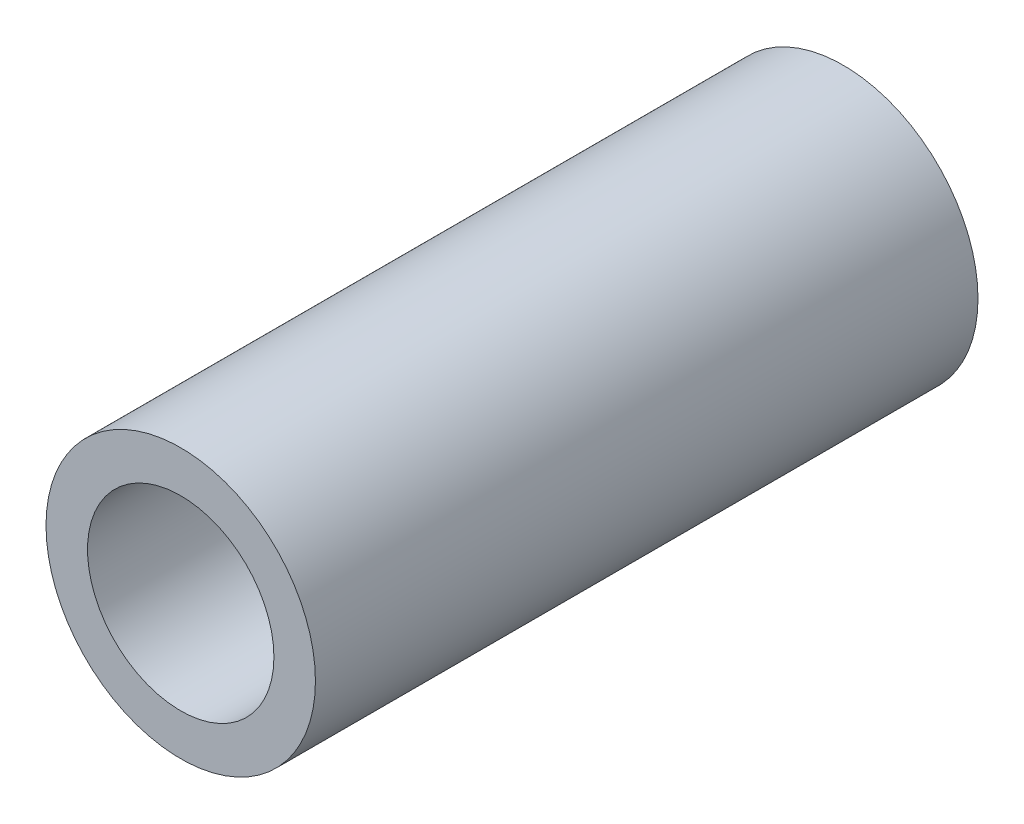
ISO-10303-21;
HEADER;
FILE_DESCRIPTION(('STEP AP214'),'2;1');
FILE_NAME('part.step','',(''),(''),'','','');
FILE_SCHEMA(('AUTOMOTIVE_DESIGN { 1 0 10303 214 1 1 1 1 }'));
ENDSEC;
DATA;
#1=APPLICATION_CONTEXT('core data for automotive mechanical design processes');
#2=APPLICATION_PROTOCOL_DEFINITION('international standard','automotive_design',2000,#1);
#3=PRODUCT_CONTEXT('',#1,'mechanical');
#4=PRODUCT('Part','Part','',(#3));
#5=PRODUCT_RELATED_PRODUCT_CATEGORY('part','',(#4));
#6=PRODUCT_DEFINITION_FORMATION('','',#4);
#7=PRODUCT_DEFINITION_CONTEXT('part definition',#1,'design');
#8=PRODUCT_DEFINITION('design','',#6,#7);
#9=PRODUCT_DEFINITION_SHAPE('','',#8);
#10=(LENGTH_UNIT() NAMED_UNIT(*) SI_UNIT(.MILLI.,.METRE.));
#11=(NAMED_UNIT(*) PLANE_ANGLE_UNIT() SI_UNIT($,.RADIAN.));
#12=(NAMED_UNIT(*) SI_UNIT($,.STERADIAN.) SOLID_ANGLE_UNIT());
#13=UNCERTAINTY_MEASURE_WITH_UNIT(LENGTH_MEASURE(1.E-05),#10,'distance_accuracy_value','');
#14=(GEOMETRIC_REPRESENTATION_CONTEXT(3) GLOBAL_UNCERTAINTY_ASSIGNED_CONTEXT((#13)) GLOBAL_UNIT_ASSIGNED_CONTEXT((#10,
#11,#12)) REPRESENTATION_CONTEXT('',''));
#15=CARTESIAN_POINT('',(0.,0.,0.));
#16=DIRECTION('',(0.,0.,1.));
#17=DIRECTION('',(1.,0.,0.));
#18=AXIS2_PLACEMENT_3D('',#15,#16,#17);
#19=CARTESIAN_POINT('',(0.,0.,38.1));
#20=DIRECTION('',(0.,0.,1.));
#21=DIRECTION('',(1.,0.,0.));
#22=AXIS2_PLACEMENT_3D('',#19,#20,#21);
#23=PLANE('',#22);
#24=CARTESIAN_POINT('',(0.,0.,38.1));
#25=DIRECTION('',(0.,0.,1.));
#26=DIRECTION('',(1.,0.,0.));
#27=AXIS2_PLACEMENT_3D('',#24,#25,#26);
#28=CIRCLE('',#27,7.747);
#29=CARTESIAN_POINT('',(7.747,0.,38.1));
#30=VERTEX_POINT('',#29);
#31=EDGE_CURVE('E10',#30,#30,#28,.T.);
#32=ORIENTED_EDGE('',*,*,#31,.T.);
#33=EDGE_LOOP('',(#32));
#34=FACE_BOUND('',#33,.T.);
#35=CARTESIAN_POINT('',(0.,0.,38.1));
#36=DIRECTION('',(0.,0.,1.));
#37=DIRECTION('',(1.,0.,0.));
#38=AXIS2_PLACEMENT_3D('',#35,#36,#37);
#39=CIRCLE('',#38,5.3594);
#40=CARTESIAN_POINT('',(5.3594,0.,38.1));
#41=VERTEX_POINT('',#40);
#42=EDGE_CURVE('E41',#41,#41,#39,.T.);
#43=ORIENTED_EDGE('',*,*,#42,.F.);
#44=EDGE_LOOP('',(#43));
#45=FACE_BOUND('',#44,.T.);
#46=ADVANCED_FACE('F30',(#34,#45),#23,.T.);
#47=CARTESIAN_POINT('',(0.,0.,0.));
#48=DIRECTION('',(0.,0.,1.));
#49=DIRECTION('',(1.,0.,0.));
#50=AXIS2_PLACEMENT_3D('',#47,#48,#49);
#51=PLANE('',#50);
#52=CARTESIAN_POINT('',(0.,0.,0.));
#53=DIRECTION('',(0.,0.,1.));
#54=DIRECTION('',(1.,0.,0.));
#55=AXIS2_PLACEMENT_3D('',#52,#53,#54);
#56=CIRCLE('',#55,7.747);
#57=CARTESIAN_POINT('',(7.747,0.,0.));
#58=VERTEX_POINT('',#57);
#59=EDGE_CURVE('E34',#58,#58,#56,.T.);
#60=ORIENTED_EDGE('',*,*,#59,.F.);
#61=EDGE_LOOP('',(#60));
#62=FACE_BOUND('',#61,.T.);
#63=CARTESIAN_POINT('',(0.,0.,0.));
#64=DIRECTION('',(0.,0.,1.));
#65=DIRECTION('',(1.,0.,0.));
#66=AXIS2_PLACEMENT_3D('',#63,#64,#65);
#67=CIRCLE('',#66,5.3594);
#68=CARTESIAN_POINT('',(5.3594,0.,0.));
#69=VERTEX_POINT('',#68);
#70=EDGE_CURVE('E43',#69,#69,#67,.T.);
#71=ORIENTED_EDGE('',*,*,#70,.T.);
#72=EDGE_LOOP('',(#71));
#73=FACE_BOUND('',#72,.T.);
#74=ADVANCED_FACE('F53',(#62,#73),#51,.F.);
#75=CARTESIAN_POINT('',(0.,0.,38.1));
#76=DIRECTION('',(0.,0.,-1.));
#77=DIRECTION('',(-1.,0.,0.));
#78=AXIS2_PLACEMENT_3D('',#75,#76,#77);
#79=CYLINDRICAL_SURFACE('',#78,7.747);
#80=ORIENTED_EDGE('',*,*,#31,.F.);
#81=EDGE_LOOP('',(#80));
#82=FACE_BOUND('',#81,.T.);
#83=ORIENTED_EDGE('',*,*,#59,.T.);
#84=EDGE_LOOP('',(#83));
#85=FACE_BOUND('',#84,.T.);
#86=ADVANCED_FACE('F32',(#82,#85),#79,.T.);
#87=CARTESIAN_POINT('',(0.,0.,38.1));
#88=DIRECTION('',(0.,0.,-1.));
#89=DIRECTION('',(-1.,0.,0.));
#90=AXIS2_PLACEMENT_3D('',#87,#88,#89);
#91=CYLINDRICAL_SURFACE('',#90,5.3594);
#92=ORIENTED_EDGE('',*,*,#42,.T.);
#93=EDGE_LOOP('',(#92));
#94=FACE_BOUND('',#93,.T.);
#95=ORIENTED_EDGE('',*,*,#70,.F.);
#96=EDGE_LOOP('',(#95));
#97=FACE_BOUND('',#96,.T.);
#98=ADVANCED_FACE('F49',(#94,#97),#91,.F.);
#99=CLOSED_SHELL('',(#46,#74,#86,#98));
#100=MANIFOLD_SOLID_BREP('B2',#99);
#101=ADVANCED_BREP_SHAPE_REPRESENTATION('',(#18,#100),#14);
#102=SHAPE_DEFINITION_REPRESENTATION(#9,#101);
ENDSEC;
END-ISO-10303-21;
